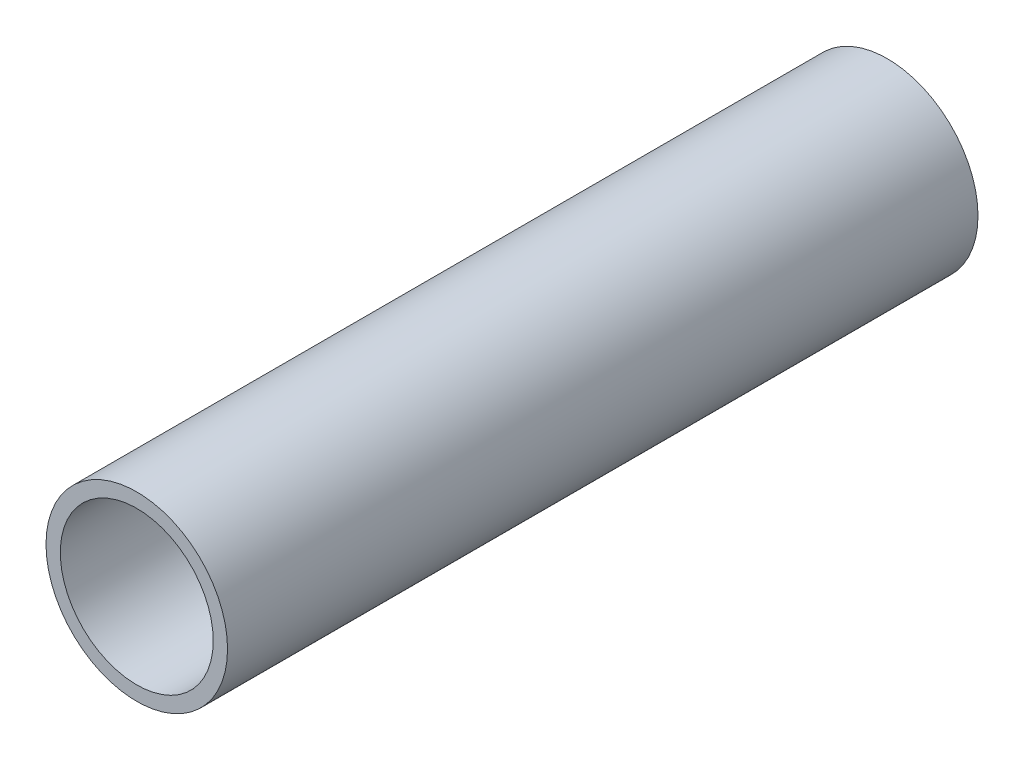
ISO-10303-21;
HEADER;
FILE_DESCRIPTION(('STEP AP214'),'2;1');
FILE_NAME('part.step','',(''),(''),'','','');
FILE_SCHEMA(('AUTOMOTIVE_DESIGN { 1 0 10303 214 1 1 1 1 }'));
ENDSEC;
DATA;
#1=APPLICATION_CONTEXT('core data for automotive mechanical design processes');
#2=APPLICATION_PROTOCOL_DEFINITION('international standard','automotive_design',2000,#1);
#3=PRODUCT_CONTEXT('',#1,'mechanical');
#4=PRODUCT('Part','Part','',(#3));
#5=PRODUCT_RELATED_PRODUCT_CATEGORY('part','',(#4));
#6=PRODUCT_DEFINITION_FORMATION('','',#4);
#7=PRODUCT_DEFINITION_CONTEXT('part definition',#1,'design');
#8=PRODUCT_DEFINITION('design','',#6,#7);
#9=PRODUCT_DEFINITION_SHAPE('','',#8);
#10=(LENGTH_UNIT() NAMED_UNIT(*) SI_UNIT(.MILLI.,.METRE.));
#11=(NAMED_UNIT(*) PLANE_ANGLE_UNIT() SI_UNIT($,.RADIAN.));
#12=(NAMED_UNIT(*) SI_UNIT($,.STERADIAN.) SOLID_ANGLE_UNIT());
#13=UNCERTAINTY_MEASURE_WITH_UNIT(LENGTH_MEASURE(1.E-05),#10,'distance_accuracy_value','');
#14=(GEOMETRIC_REPRESENTATION_CONTEXT(3) GLOBAL_UNCERTAINTY_ASSIGNED_CONTEXT((#13)) GLOBAL_UNIT_ASSIGNED_CONTEXT((#10,
#11,#12)) REPRESENTATION_CONTEXT('',''));
#15=CARTESIAN_POINT('',(0.,0.,0.));
#16=DIRECTION('',(0.,0.,1.));
#17=DIRECTION('',(1.,0.,0.));
#18=AXIS2_PLACEMENT_3D('',#15,#16,#17);
#19=CARTESIAN_POINT('',(0.,0.,-105.));
#20=DIRECTION('',(0.,0.,-1.));
#21=DIRECTION('',(1.,0.,0.));
#22=AXIS2_PLACEMENT_3D('',#19,#20,#21);
#23=PLANE('',#22);
#24=CARTESIAN_POINT('',(0.,0.,-105.));
#25=DIRECTION('',(0.,0.,1.));
#26=DIRECTION('',(1.,0.,0.));
#27=AXIS2_PLACEMENT_3D('',#24,#25,#26);
#28=CIRCLE('',#27,12.7);
#29=CARTESIAN_POINT('',(12.7,0.,-105.));
#30=VERTEX_POINT('',#29);
#31=EDGE_CURVE('E10',#30,#30,#28,.T.);
#32=ORIENTED_EDGE('',*,*,#31,.F.);
#33=EDGE_LOOP('',(#32));
#34=FACE_BOUND('',#33,.T.);
#35=CARTESIAN_POINT('',(0.,0.,-105.));
#36=DIRECTION('',(0.,0.,1.));
#37=DIRECTION('',(1.,0.,0.));
#38=AXIS2_PLACEMENT_3D('',#35,#36,#37);
#39=CIRCLE('',#38,10.7);
#40=CARTESIAN_POINT('',(10.7,0.,-105.));
#41=VERTEX_POINT('',#40);
#42=EDGE_CURVE('E48',#41,#41,#39,.T.);
#43=ORIENTED_EDGE('',*,*,#42,.T.);
#44=EDGE_LOOP('',(#43));
#45=FACE_BOUND('',#44,.T.);
#46=ADVANCED_FACE('F37',(#34,#45),#23,.T.);
#47=CARTESIAN_POINT('',(0.,0.,0.));
#48=DIRECTION('',(0.,0.,-1.));
#49=DIRECTION('',(1.,0.,0.));
#50=AXIS2_PLACEMENT_3D('',#47,#48,#49);
#51=PLANE('',#50);
#52=CARTESIAN_POINT('',(0.,0.,0.));
#53=DIRECTION('',(0.,0.,1.));
#54=DIRECTION('',(1.,0.,0.));
#55=AXIS2_PLACEMENT_3D('',#52,#53,#54);
#56=CIRCLE('',#55,12.7);
#57=CARTESIAN_POINT('',(12.7,0.,0.));
#58=VERTEX_POINT('',#57);
#59=EDGE_CURVE('E41',#58,#58,#56,.T.);
#60=ORIENTED_EDGE('',*,*,#59,.T.);
#61=EDGE_LOOP('',(#60));
#62=FACE_BOUND('',#61,.T.);
#63=CARTESIAN_POINT('',(0.,0.,0.));
#64=DIRECTION('',(0.,0.,1.));
#65=DIRECTION('',(1.,0.,0.));
#66=AXIS2_PLACEMENT_3D('',#63,#64,#65);
#67=CIRCLE('',#66,10.7);
#68=CARTESIAN_POINT('',(10.7,0.,0.));
#69=VERTEX_POINT('',#68);
#70=EDGE_CURVE('E50',#69,#69,#67,.T.);
#71=ORIENTED_EDGE('',*,*,#70,.F.);
#72=EDGE_LOOP('',(#71));
#73=FACE_BOUND('',#72,.T.);
#74=ADVANCED_FACE('F63',(#62,#73),#51,.F.);
#75=CARTESIAN_POINT('',(0.,0.,-105.));
#76=DIRECTION('',(0.,0.,1.));
#77=DIRECTION('',(-1.,0.,0.));
#78=AXIS2_PLACEMENT_3D('',#75,#76,#77);
#79=CYLINDRICAL_SURFACE('',#78,12.7);
#80=ORIENTED_EDGE('',*,*,#31,.T.);
#81=EDGE_LOOP('',(#80));
#82=FACE_BOUND('',#81,.T.);
#83=ORIENTED_EDGE('',*,*,#59,.F.);
#84=EDGE_LOOP('',(#83));
#85=FACE_BOUND('',#84,.T.);
#86=ADVANCED_FACE('F39',(#82,#85),#79,.T.);
#87=CARTESIAN_POINT('',(0.,0.,-105.));
#88=DIRECTION('',(0.,0.,1.));
#89=DIRECTION('',(-1.,0.,0.));
#90=AXIS2_PLACEMENT_3D('',#87,#88,#89);
#91=CYLINDRICAL_SURFACE('',#90,10.7);
#92=ORIENTED_EDGE('',*,*,#42,.F.);
#93=EDGE_LOOP('',(#92));
#94=FACE_BOUND('',#93,.T.);
#95=ORIENTED_EDGE('',*,*,#70,.T.);
#96=EDGE_LOOP('',(#95));
#97=FACE_BOUND('',#96,.T.);
#98=ADVANCED_FACE('F57',(#94,#97),#91,.F.);
#99=CLOSED_SHELL('',(#46,#74,#86,#98));
#100=MANIFOLD_SOLID_BREP('B2',#99);
#101=ADVANCED_BREP_SHAPE_REPRESENTATION('',(#18,#100),#14);
#102=SHAPE_DEFINITION_REPRESENTATION(#9,#101);
ENDSEC;
END-ISO-10303-21;
